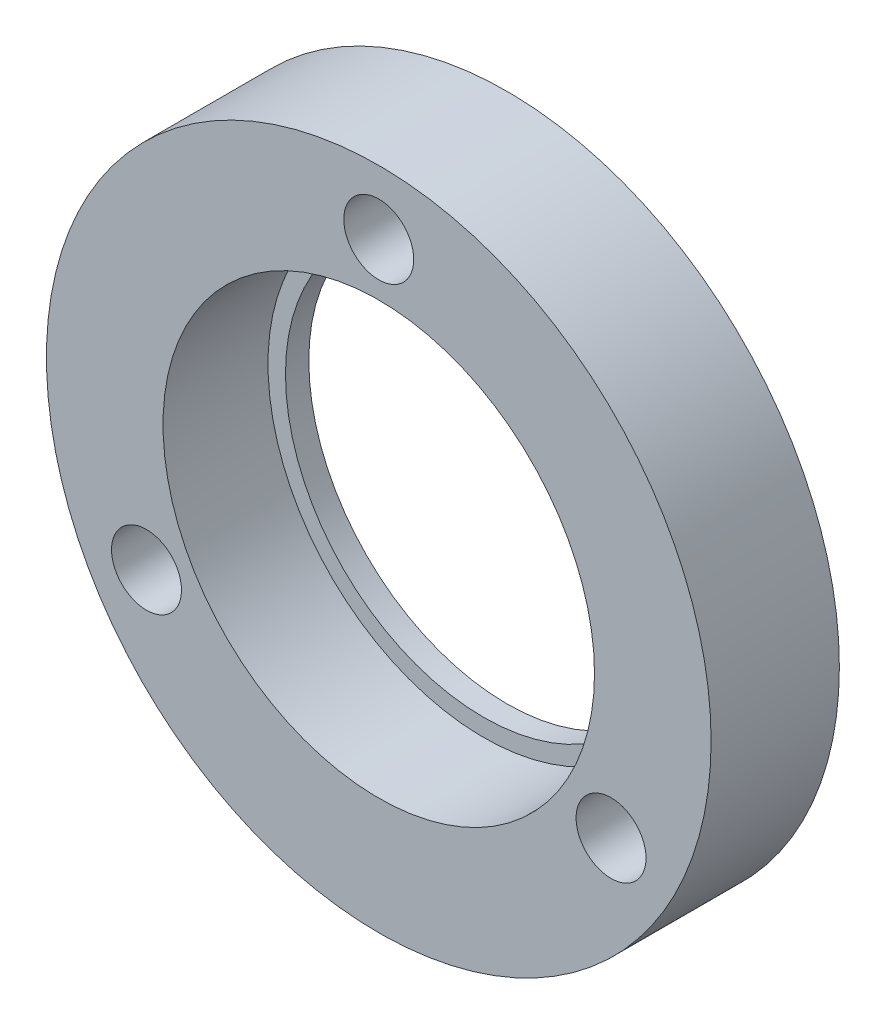
ISO-10303-21;
HEADER;
FILE_DESCRIPTION(('STEP AP214'),'2;1');
FILE_NAME('part.step','',(''),(''),'','','');
FILE_SCHEMA(('AUTOMOTIVE_DESIGN { 1 0 10303 214 1 1 1 1 }'));
ENDSEC;
DATA;
#1=APPLICATION_CONTEXT('core data for automotive mechanical design processes');
#2=APPLICATION_PROTOCOL_DEFINITION('international standard','automotive_design',2000,#1);
#3=PRODUCT_CONTEXT('',#1,'mechanical');
#4=PRODUCT('Part','Part','',(#3));
#5=PRODUCT_RELATED_PRODUCT_CATEGORY('part','',(#4));
#6=PRODUCT_DEFINITION_FORMATION('','',#4);
#7=PRODUCT_DEFINITION_CONTEXT('part definition',#1,'design');
#8=PRODUCT_DEFINITION('design','',#6,#7);
#9=PRODUCT_DEFINITION_SHAPE('','',#8);
#10=(LENGTH_UNIT() NAMED_UNIT(*) SI_UNIT(.MILLI.,.METRE.));
#11=(NAMED_UNIT(*) PLANE_ANGLE_UNIT() SI_UNIT($,.RADIAN.));
#12=(NAMED_UNIT(*) SI_UNIT($,.STERADIAN.) SOLID_ANGLE_UNIT());
#13=UNCERTAINTY_MEASURE_WITH_UNIT(LENGTH_MEASURE(1.E-05),#10,'distance_accuracy_value','');
#14=(GEOMETRIC_REPRESENTATION_CONTEXT(3) GLOBAL_UNCERTAINTY_ASSIGNED_CONTEXT((#13)) GLOBAL_UNIT_ASSIGNED_CONTEXT((#10,
#11,#12)) REPRESENTATION_CONTEXT('',''));
#15=CARTESIAN_POINT('',(0.,0.,0.));
#16=DIRECTION('',(0.,0.,1.));
#17=DIRECTION('',(1.,0.,0.));
#18=AXIS2_PLACEMENT_3D('',#15,#16,#17);
#19=CARTESIAN_POINT('',(0.,0.,11.));
#20=DIRECTION('',(0.,0.,-1.));
#21=DIRECTION('',(-1.,0.,0.));
#22=AXIS2_PLACEMENT_3D('',#19,#20,#21);
#23=CYLINDRICAL_SURFACE('',#22,28.5);
#24=CARTESIAN_POINT('',(0.,0.,11.));
#25=DIRECTION('',(0.,0.,1.));
#26=DIRECTION('',(1.,0.,0.));
#27=AXIS2_PLACEMENT_3D('',#24,#25,#26);
#28=CIRCLE('',#27,28.5);
#29=CARTESIAN_POINT('',(28.5,0.,11.));
#30=VERTEX_POINT('',#29);
#31=EDGE_CURVE('E10',#30,#30,#28,.T.);
#32=ORIENTED_EDGE('',*,*,#31,.F.);
#33=EDGE_LOOP('',(#32));
#34=FACE_BOUND('',#33,.T.);
#35=CARTESIAN_POINT('',(0.,0.,0.));
#36=DIRECTION('',(0.,0.,1.));
#37=DIRECTION('',(1.,0.,0.));
#38=AXIS2_PLACEMENT_3D('',#35,#36,#37);
#39=CIRCLE('',#38,28.5);
#40=CARTESIAN_POINT('',(28.5,0.,0.));
#41=VERTEX_POINT('',#40);
#42=EDGE_CURVE('E35',#41,#41,#39,.T.);
#43=ORIENTED_EDGE('',*,*,#42,.T.);
#44=EDGE_LOOP('',(#43));
#45=FACE_BOUND('',#44,.T.);
#46=ADVANCED_FACE('F32',(#34,#45),#23,.T.);
#47=CARTESIAN_POINT('',(0.,0.,11.));
#48=DIRECTION('',(0.,0.,1.));
#49=DIRECTION('',(1.,0.,0.));
#50=AXIS2_PLACEMENT_3D('',#47,#48,#49);
#51=PLANE('',#50);
#52=CARTESIAN_POINT('',(-19.9185842870411,-11.5000000000006,11.));
#53=DIRECTION('',(0.,0.,1.));
#54=DIRECTION('',(1.,0.,0.));
#55=AXIS2_PLACEMENT_3D('',#52,#53,#54);
#56=CIRCLE('',#55,3.00000000000178);
#57=CARTESIAN_POINT('',(-16.9185842870393,-11.5000000000006,11.));
#58=VERTEX_POINT('',#57);
#59=EDGE_CURVE('E68',#58,#58,#56,.T.);
#60=ORIENTED_EDGE('',*,*,#59,.F.);
#61=EDGE_LOOP('',(#60));
#62=FACE_BOUND('',#61,.T.);
#63=CARTESIAN_POINT('',(19.9185842870431,-11.4999999999994,11.));
#64=DIRECTION('',(0.,0.,1.));
#65=DIRECTION('',(1.,0.,0.));
#66=AXIS2_PLACEMENT_3D('',#63,#64,#65);
#67=CIRCLE('',#66,3.00000000000126);
#68=CARTESIAN_POINT('',(22.9185842870443,-11.4999999999994,11.));
#69=VERTEX_POINT('',#68);
#70=EDGE_CURVE('E62',#69,#69,#67,.T.);
#71=ORIENTED_EDGE('',*,*,#70,.F.);
#72=EDGE_LOOP('',(#71));
#73=FACE_BOUND('',#72,.T.);
#74=CARTESIAN_POINT('',(0.,23.,11.));
#75=DIRECTION('',(0.,0.,1.));
#76=DIRECTION('',(1.,0.,0.));
#77=AXIS2_PLACEMENT_3D('',#74,#75,#76);
#78=CIRCLE('',#77,3.);
#79=CARTESIAN_POINT('',(3.,23.,11.));
#80=VERTEX_POINT('',#79);
#81=EDGE_CURVE('E56',#80,#80,#78,.T.);
#82=ORIENTED_EDGE('',*,*,#81,.F.);
#83=EDGE_LOOP('',(#82));
#84=FACE_BOUND('',#83,.T.);
#85=CARTESIAN_POINT('',(0.,0.,11.));
#86=DIRECTION('',(0.,0.,1.));
#87=DIRECTION('',(1.,0.,0.));
#88=AXIS2_PLACEMENT_3D('',#85,#86,#87);
#89=CIRCLE('',#88,18.5);
#90=CARTESIAN_POINT('',(18.5,0.,11.));
#91=VERTEX_POINT('',#90);
#92=EDGE_CURVE('E44',#91,#91,#89,.T.);
#93=ORIENTED_EDGE('',*,*,#92,.F.);
#94=EDGE_LOOP('',(#93));
#95=FACE_BOUND('',#94,.T.);
#96=ORIENTED_EDGE('',*,*,#31,.T.);
#97=EDGE_LOOP('',(#96));
#98=FACE_BOUND('',#97,.T.);
#99=ADVANCED_FACE('F84',(#62,#73,#84,#95,#98),#51,.T.);
#100=CARTESIAN_POINT('',(0.,0.,0.));
#101=DIRECTION('',(0.,0.,1.));
#102=DIRECTION('',(1.,0.,0.));
#103=AXIS2_PLACEMENT_3D('',#100,#101,#102);
#104=PLANE('',#103);
#105=CARTESIAN_POINT('',(-19.9185842870411,-11.5000000000006,0.));
#106=DIRECTION('',(0.,0.,1.));
#107=DIRECTION('',(1.,0.,0.));
#108=AXIS2_PLACEMENT_3D('',#105,#106,#107);
#109=CIRCLE('',#108,3.00000000000178);
#110=CARTESIAN_POINT('',(-16.9185842870393,-11.5000000000006,0.));
#111=VERTEX_POINT('',#110);
#112=EDGE_CURVE('E65',#111,#111,#109,.T.);
#113=ORIENTED_EDGE('',*,*,#112,.T.);
#114=EDGE_LOOP('',(#113));
#115=FACE_BOUND('',#114,.T.);
#116=CARTESIAN_POINT('',(19.9185842870431,-11.4999999999994,0.));
#117=DIRECTION('',(0.,0.,1.));
#118=DIRECTION('',(1.,0.,0.));
#119=AXIS2_PLACEMENT_3D('',#116,#117,#118);
#120=CIRCLE('',#119,3.00000000000126);
#121=CARTESIAN_POINT('',(22.9185842870443,-11.4999999999994,0.));
#122=VERTEX_POINT('',#121);
#123=EDGE_CURVE('E59',#122,#122,#120,.T.);
#124=ORIENTED_EDGE('',*,*,#123,.T.);
#125=EDGE_LOOP('',(#124));
#126=FACE_BOUND('',#125,.T.);
#127=CARTESIAN_POINT('',(0.,23.,0.));
#128=DIRECTION('',(0.,0.,1.));
#129=DIRECTION('',(1.,0.,0.));
#130=AXIS2_PLACEMENT_3D('',#127,#128,#129);
#131=CIRCLE('',#130,3.);
#132=CARTESIAN_POINT('',(3.,23.,0.));
#133=VERTEX_POINT('',#132);
#134=EDGE_CURVE('E53',#133,#133,#131,.T.);
#135=ORIENTED_EDGE('',*,*,#134,.T.);
#136=EDGE_LOOP('',(#135));
#137=FACE_BOUND('',#136,.T.);
#138=CARTESIAN_POINT('',(0.,0.,0.));
#139=DIRECTION('',(0.,0.,1.));
#140=DIRECTION('',(1.,0.,0.));
#141=AXIS2_PLACEMENT_3D('',#138,#139,#140);
#142=CIRCLE('',#141,17.);
#143=CARTESIAN_POINT('',(17.,0.,0.));
#144=VERTEX_POINT('',#143);
#145=EDGE_CURVE('E47',#144,#144,#142,.T.);
#146=ORIENTED_EDGE('',*,*,#145,.T.);
#147=EDGE_LOOP('',(#146));
#148=FACE_BOUND('',#147,.T.);
#149=ORIENTED_EDGE('',*,*,#42,.F.);
#150=EDGE_LOOP('',(#149));
#151=FACE_BOUND('',#150,.T.);
#152=ADVANCED_FACE('F74',(#115,#126,#137,#148,#151),#104,.F.);
#153=CARTESIAN_POINT('',(0.,0.,2.));
#154=DIRECTION('',(0.,0.,1.));
#155=DIRECTION('',(1.,0.,0.));
#156=AXIS2_PLACEMENT_3D('',#153,#154,#155);
#157=CYLINDRICAL_SURFACE('',#156,18.5);
#158=CARTESIAN_POINT('',(0.,0.,2.));
#159=DIRECTION('',(0.,0.,1.));
#160=DIRECTION('',(1.,0.,0.));
#161=AXIS2_PLACEMENT_3D('',#158,#159,#160);
#162=CIRCLE('',#161,18.5);
#163=CARTESIAN_POINT('',(18.5,0.,2.));
#164=VERTEX_POINT('',#163);
#165=EDGE_CURVE('E42',#164,#164,#162,.T.);
#166=ORIENTED_EDGE('',*,*,#165,.F.);
#167=EDGE_LOOP('',(#166));
#168=FACE_BOUND('',#167,.T.);
#169=ORIENTED_EDGE('',*,*,#92,.T.);
#170=EDGE_LOOP('',(#169));
#171=FACE_BOUND('',#170,.T.);
#172=ADVANCED_FACE('F94',(#168,#171),#157,.F.);
#173=CARTESIAN_POINT('',(0.,0.,2.));
#174=DIRECTION('',(0.,0.,1.));
#175=DIRECTION('',(1.,0.,0.));
#176=AXIS2_PLACEMENT_3D('',#173,#174,#175);
#177=PLANE('',#176);
#178=CARTESIAN_POINT('',(0.,0.,2.));
#179=DIRECTION('',(0.,0.,1.));
#180=DIRECTION('',(1.,0.,0.));
#181=AXIS2_PLACEMENT_3D('',#178,#179,#180);
#182=CIRCLE('',#181,17.);
#183=CARTESIAN_POINT('',(17.,0.,2.));
#184=VERTEX_POINT('',#183);
#185=EDGE_CURVE('E50',#184,#184,#182,.T.);
#186=ORIENTED_EDGE('',*,*,#185,.F.);
#187=EDGE_LOOP('',(#186));
#188=FACE_BOUND('',#187,.T.);
#189=ORIENTED_EDGE('',*,*,#165,.T.);
#190=EDGE_LOOP('',(#189));
#191=FACE_BOUND('',#190,.T.);
#192=ADVANCED_FACE('F96',(#188,#191),#177,.T.);
#193=CARTESIAN_POINT('',(0.,0.,0.));
#194=DIRECTION('',(0.,0.,1.));
#195=DIRECTION('',(1.,0.,0.));
#196=AXIS2_PLACEMENT_3D('',#193,#194,#195);
#197=CYLINDRICAL_SURFACE('',#196,17.);
#198=ORIENTED_EDGE('',*,*,#145,.F.);
#199=EDGE_LOOP('',(#198));
#200=FACE_BOUND('',#199,.T.);
#201=ORIENTED_EDGE('',*,*,#185,.T.);
#202=EDGE_LOOP('',(#201));
#203=FACE_BOUND('',#202,.T.);
#204=ADVANCED_FACE('F103',(#200,#203),#197,.F.);
#205=CARTESIAN_POINT('',(0.,23.,0.));
#206=DIRECTION('',(0.,0.,1.));
#207=DIRECTION('',(1.,0.,0.));
#208=AXIS2_PLACEMENT_3D('',#205,#206,#207);
#209=CYLINDRICAL_SURFACE('',#208,3.);
#210=ORIENTED_EDGE('',*,*,#134,.F.);
#211=EDGE_LOOP('',(#210));
#212=FACE_BOUND('',#211,.T.);
#213=ORIENTED_EDGE('',*,*,#81,.T.);
#214=EDGE_LOOP('',(#213));
#215=FACE_BOUND('',#214,.T.);
#216=ADVANCED_FACE('F131',(#212,#215),#209,.F.);
#217=CARTESIAN_POINT('',(19.9185842870431,-11.4999999999994,0.));
#218=DIRECTION('',(0.,0.,1.));
#219=DIRECTION('',(1.,0.,0.));
#220=AXIS2_PLACEMENT_3D('',#217,#218,#219);
#221=CYLINDRICAL_SURFACE('',#220,3.00000000000126);
#222=ORIENTED_EDGE('',*,*,#123,.F.);
#223=EDGE_LOOP('',(#222));
#224=FACE_BOUND('',#223,.T.);
#225=ORIENTED_EDGE('',*,*,#70,.T.);
#226=EDGE_LOOP('',(#225));
#227=FACE_BOUND('',#226,.T.);
#228=ADVANCED_FACE('F80',(#224,#227),#221,.F.);
#229=CARTESIAN_POINT('',(-19.9185842870411,-11.5000000000006,0.));
#230=DIRECTION('',(0.,0.,1.));
#231=DIRECTION('',(1.,0.,0.));
#232=AXIS2_PLACEMENT_3D('',#229,#230,#231);
#233=CYLINDRICAL_SURFACE('',#232,3.00000000000178);
#234=ORIENTED_EDGE('',*,*,#112,.F.);
#235=EDGE_LOOP('',(#234));
#236=FACE_BOUND('',#235,.T.);
#237=ORIENTED_EDGE('',*,*,#59,.T.);
#238=EDGE_LOOP('',(#237));
#239=FACE_BOUND('',#238,.T.);
#240=ADVANCED_FACE('F77',(#236,#239),#233,.F.);
#241=CLOSED_SHELL('',(#46,#99,#152,#172,#192,#204,#216,#228,#240));
#242=MANIFOLD_SOLID_BREP('B2',#241);
#243=ADVANCED_BREP_SHAPE_REPRESENTATION('',(#18,#242),#14);
#244=SHAPE_DEFINITION_REPRESENTATION(#9,#243);
ENDSEC;
END-ISO-10303-21;
